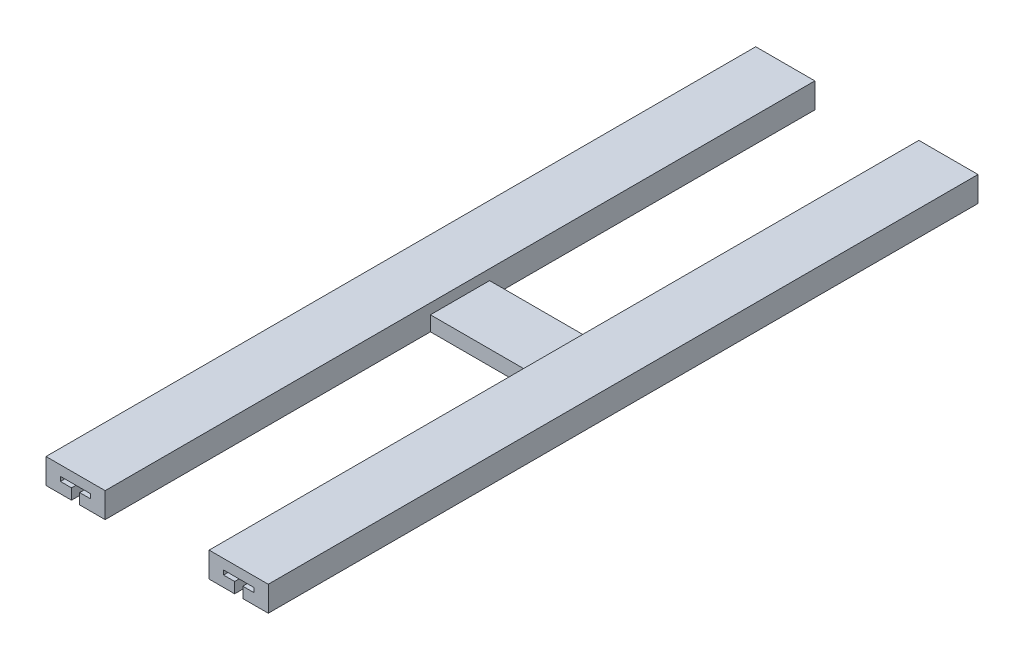
ISO-10303-21;
HEADER;
FILE_DESCRIPTION(('STEP AP214'),'2;1');
FILE_NAME('part.step','',(''),(''),'','','');
FILE_SCHEMA(('AUTOMOTIVE_DESIGN { 1 0 10303 214 1 1 1 1 }'));
ENDSEC;
DATA;
#1=APPLICATION_CONTEXT('core data for automotive mechanical design processes');
#2=APPLICATION_PROTOCOL_DEFINITION('international standard','automotive_design',2000,#1);
#3=PRODUCT_CONTEXT('',#1,'mechanical');
#4=PRODUCT('Part','Part','',(#3));
#5=PRODUCT_RELATED_PRODUCT_CATEGORY('part','',(#4));
#6=PRODUCT_DEFINITION_FORMATION('','',#4);
#7=PRODUCT_DEFINITION_CONTEXT('part definition',#1,'design');
#8=PRODUCT_DEFINITION('design','',#6,#7);
#9=PRODUCT_DEFINITION_SHAPE('','',#8);
#10=(LENGTH_UNIT() NAMED_UNIT(*) SI_UNIT(.MILLI.,.METRE.));
#11=(NAMED_UNIT(*) PLANE_ANGLE_UNIT() SI_UNIT($,.RADIAN.));
#12=(NAMED_UNIT(*) SI_UNIT($,.STERADIAN.) SOLID_ANGLE_UNIT());
#13=UNCERTAINTY_MEASURE_WITH_UNIT(LENGTH_MEASURE(1.E-05),#10,'distance_accuracy_value','');
#14=(GEOMETRIC_REPRESENTATION_CONTEXT(3) GLOBAL_UNCERTAINTY_ASSIGNED_CONTEXT((#13)) GLOBAL_UNIT_ASSIGNED_CONTEXT((#10,
#11,#12)) REPRESENTATION_CONTEXT('',''));
#15=CARTESIAN_POINT('',(0.,0.,0.));
#16=DIRECTION('',(0.,0.,1.));
#17=DIRECTION('',(1.,0.,0.));
#18=AXIS2_PLACEMENT_3D('',#15,#16,#17);
#19=CARTESIAN_POINT('',(110.,17.,-10.));
#20=DIRECTION('',(0.,0.,-1.));
#21=DIRECTION('',(-1.,0.,0.));
#22=AXIS2_PLACEMENT_3D('',#19,#20,#21);
#23=PLANE('',#22);
#24=DIRECTION('',(0.,-1.,0.));
#25=VECTOR('',#24,1.);
#26=CARTESIAN_POINT('',(127.25,17.,-10.));
#27=LINE('',#26,#25);
#28=CARTESIAN_POINT('',(127.25,7.25,-10.));
#29=VERTEX_POINT('',#28);
#30=CARTESIAN_POINT('',(127.25,0.,-10.));
#31=VERTEX_POINT('',#30);
#32=EDGE_CURVE('E270',#29,#31,#27,.T.);
#33=ORIENTED_EDGE('',*,*,#32,.F.);
#34=DIRECTION('',(1.,0.,0.));
#35=VECTOR('',#34,1.);
#36=CARTESIAN_POINT('',(110.,7.25,-10.));
#37=LINE('',#36,#35);
#38=CARTESIAN_POINT('',(119.75,7.25,-10.));
#39=VERTEX_POINT('',#38);
#40=EDGE_CURVE('E280',#39,#29,#37,.T.);
#41=ORIENTED_EDGE('',*,*,#40,.F.);
#42=DIRECTION('',(0.,-1.,0.));
#43=VECTOR('',#42,1.);
#44=CARTESIAN_POINT('',(119.75,17.,-10.));
#45=LINE('',#44,#43);
#46=CARTESIAN_POINT('',(119.75,10.25,-10.));
#47=VERTEX_POINT('',#46);
#48=EDGE_CURVE('E278',#47,#39,#45,.T.);
#49=ORIENTED_EDGE('',*,*,#48,.F.);
#50=DIRECTION('',(-1.,0.,0.));
#51=VECTOR('',#50,1.);
#52=CARTESIAN_POINT('',(110.,10.25,-10.));
#53=LINE('',#52,#51);
#54=CARTESIAN_POINT('',(140.25,10.25,-10.));
#55=VERTEX_POINT('',#54);
#56=EDGE_CURVE('E276',#55,#47,#53,.T.);
#57=ORIENTED_EDGE('',*,*,#56,.F.);
#58=DIRECTION('',(0.,1.,0.));
#59=VECTOR('',#58,1.);
#60=CARTESIAN_POINT('',(140.25,17.,-10.));
#61=LINE('',#60,#59);
#62=CARTESIAN_POINT('',(140.25,7.25,-10.));
#63=VERTEX_POINT('',#62);
#64=EDGE_CURVE('E274',#63,#55,#61,.T.);
#65=ORIENTED_EDGE('',*,*,#64,.F.);
#66=DIRECTION('',(1.,0.,0.));
#67=VECTOR('',#66,1.);
#68=CARTESIAN_POINT('',(110.,7.24999999999999,-10.));
#69=LINE('',#68,#67);
#70=CARTESIAN_POINT('',(132.75,7.25,-10.));
#71=VERTEX_POINT('',#70);
#72=EDGE_CURVE('E272',#71,#63,#69,.T.);
#73=ORIENTED_EDGE('',*,*,#72,.F.);
#74=DIRECTION('',(0.,1.,0.));
#75=VECTOR('',#74,1.);
#76=CARTESIAN_POINT('',(132.75,17.,-10.));
#77=LINE('',#76,#75);
#78=CARTESIAN_POINT('',(132.75,0.,-10.));
#79=VERTEX_POINT('',#78);
#80=EDGE_CURVE('E232',#79,#71,#77,.T.);
#81=ORIENTED_EDGE('',*,*,#80,.F.);
#82=DIRECTION('',(1.,0.,0.));
#83=VECTOR('',#82,1.);
#84=CARTESIAN_POINT('',(110.,0.,-10.));
#85=LINE('',#84,#83);
#86=CARTESIAN_POINT('',(150.,0.,-10.));
#87=VERTEX_POINT('',#86);
#88=EDGE_CURVE('E386',#79,#87,#85,.T.);
#89=ORIENTED_EDGE('',*,*,#88,.T.);
#90=DIRECTION('',(0.,-1.,0.));
#91=VECTOR('',#90,1.);
#92=CARTESIAN_POINT('',(150.,17.,-10.));
#93=LINE('',#92,#91);
#94=CARTESIAN_POINT('',(150.,17.,-10.));
#95=VERTEX_POINT('',#94);
#96=EDGE_CURVE('E402',#95,#87,#93,.T.);
#97=ORIENTED_EDGE('',*,*,#96,.F.);
#98=DIRECTION('',(1.,0.,0.));
#99=VECTOR('',#98,1.);
#100=CARTESIAN_POINT('',(110.,17.,-10.));
#101=LINE('',#100,#99);
#102=CARTESIAN_POINT('',(110.,17.,-10.));
#103=VERTEX_POINT('',#102);
#104=EDGE_CURVE('E356',#103,#95,#101,.T.);
#105=ORIENTED_EDGE('',*,*,#104,.F.);
#106=DIRECTION('',(0.,-1.,0.));
#107=VECTOR('',#106,1.);
#108=CARTESIAN_POINT('',(110.,17.,-10.));
#109=LINE('',#108,#107);
#110=CARTESIAN_POINT('',(110.,0.,-10.));
#111=VERTEX_POINT('',#110);
#112=EDGE_CURVE('E405',#103,#111,#109,.T.);
#113=ORIENTED_EDGE('',*,*,#112,.T.);
#114=EDGE_CURVE('E387',#111,#31,#85,.T.);
#115=ORIENTED_EDGE('',*,*,#114,.T.);
#116=EDGE_LOOP('',(#33,#41,#49,#57,#65,#73,#81,#89,#97,#105,#113,#115));
#117=FACE_BOUND('',#116,.T.);
#118=ADVANCED_FACE('F33',(#117),#23,.F.);
#119=CARTESIAN_POINT('',(110.,17.,-490.));
#120=DIRECTION('',(0.,0.,1.));
#121=DIRECTION('',(1.,0.,0.));
#122=AXIS2_PLACEMENT_3D('',#119,#120,#121);
#123=PLANE('',#122);
#124=DIRECTION('',(0.,1.,0.));
#125=VECTOR('',#124,1.);
#126=CARTESIAN_POINT('',(127.25,7.25,-490.));
#127=LINE('',#126,#125);
#128=CARTESIAN_POINT('',(127.25,0.,-490.));
#129=VERTEX_POINT('',#128);
#130=CARTESIAN_POINT('',(127.25,7.25,-490.));
#131=VERTEX_POINT('',#130);
#132=EDGE_CURVE('E250',#129,#131,#127,.T.);
#133=ORIENTED_EDGE('',*,*,#132,.F.);
#134=DIRECTION('',(-1.,0.,0.));
#135=VECTOR('',#134,1.);
#136=CARTESIAN_POINT('',(110.,0.,-490.));
#137=LINE('',#136,#135);
#138=CARTESIAN_POINT('',(110.,0.,-490.));
#139=VERTEX_POINT('',#138);
#140=EDGE_CURVE('E392',#129,#139,#137,.T.);
#141=ORIENTED_EDGE('',*,*,#140,.T.);
#142=DIRECTION('',(0.,-1.,0.));
#143=VECTOR('',#142,1.);
#144=CARTESIAN_POINT('',(110.,17.,-490.));
#145=LINE('',#144,#143);
#146=CARTESIAN_POINT('',(110.,17.,-490.));
#147=VERTEX_POINT('',#146);
#148=EDGE_CURVE('E397',#147,#139,#145,.T.);
#149=ORIENTED_EDGE('',*,*,#148,.F.);
#150=DIRECTION('',(-1.,0.,0.));
#151=VECTOR('',#150,1.);
#152=CARTESIAN_POINT('',(110.,17.,-490.));
#153=LINE('',#152,#151);
#154=CARTESIAN_POINT('',(150.,17.,-490.));
#155=VERTEX_POINT('',#154);
#156=EDGE_CURVE('E360',#155,#147,#153,.T.);
#157=ORIENTED_EDGE('',*,*,#156,.F.);
#158=DIRECTION('',(0.,-1.,0.));
#159=VECTOR('',#158,1.);
#160=CARTESIAN_POINT('',(150.,17.,-490.));
#161=LINE('',#160,#159);
#162=CARTESIAN_POINT('',(150.,0.,-490.));
#163=VERTEX_POINT('',#162);
#164=EDGE_CURVE('E400',#155,#163,#161,.T.);
#165=ORIENTED_EDGE('',*,*,#164,.T.);
#166=CARTESIAN_POINT('',(132.75,0.,-490.));
#167=VERTEX_POINT('',#166);
#168=EDGE_CURVE('E240',#163,#167,#137,.T.);
#169=ORIENTED_EDGE('',*,*,#168,.T.);
#170=DIRECTION('',(0.,-1.,0.));
#171=VECTOR('',#170,1.);
#172=CARTESIAN_POINT('',(132.75,0.,-490.));
#173=LINE('',#172,#171);
#174=CARTESIAN_POINT('',(132.75,7.25,-490.));
#175=VERTEX_POINT('',#174);
#176=EDGE_CURVE('E48',#175,#167,#173,.T.);
#177=ORIENTED_EDGE('',*,*,#176,.F.);
#178=DIRECTION('',(-1.,0.,0.));
#179=VECTOR('',#178,1.);
#180=CARTESIAN_POINT('',(132.75,7.25,-490.));
#181=LINE('',#180,#179);
#182=CARTESIAN_POINT('',(140.25,7.25,-490.));
#183=VERTEX_POINT('',#182);
#184=EDGE_CURVE('E220',#183,#175,#181,.T.);
#185=ORIENTED_EDGE('',*,*,#184,.F.);
#186=DIRECTION('',(0.,-1.,0.));
#187=VECTOR('',#186,1.);
#188=CARTESIAN_POINT('',(140.25,7.25,-490.));
#189=LINE('',#188,#187);
#190=CARTESIAN_POINT('',(140.25,10.25,-490.));
#191=VERTEX_POINT('',#190);
#192=EDGE_CURVE('E228',#191,#183,#189,.T.);
#193=ORIENTED_EDGE('',*,*,#192,.F.);
#194=DIRECTION('',(1.,0.,0.));
#195=VECTOR('',#194,1.);
#196=CARTESIAN_POINT('',(140.25,10.25,-490.));
#197=LINE('',#196,#195);
#198=CARTESIAN_POINT('',(119.75,10.25,-490.));
#199=VERTEX_POINT('',#198);
#200=EDGE_CURVE('E244',#199,#191,#197,.T.);
#201=ORIENTED_EDGE('',*,*,#200,.F.);
#202=DIRECTION('',(0.,1.,0.));
#203=VECTOR('',#202,1.);
#204=CARTESIAN_POINT('',(119.75,10.25,-490.));
#205=LINE('',#204,#203);
#206=CARTESIAN_POINT('',(119.75,7.25,-490.));
#207=VERTEX_POINT('',#206);
#208=EDGE_CURVE('E246',#207,#199,#205,.T.);
#209=ORIENTED_EDGE('',*,*,#208,.F.);
#210=DIRECTION('',(-1.,0.,0.));
#211=VECTOR('',#210,1.);
#212=CARTESIAN_POINT('',(119.75,7.25,-490.));
#213=LINE('',#212,#211);
#214=EDGE_CURVE('E248',#131,#207,#213,.T.);
#215=ORIENTED_EDGE('',*,*,#214,.F.);
#216=EDGE_LOOP('',(#133,#141,#149,#157,#165,#169,#177,#185,#193,#201,#209,#215));
#217=FACE_BOUND('',#216,.T.);
#218=ADVANCED_FACE('F237',(#217),#123,.F.);
#219=CARTESIAN_POINT('',(0.,0.,0.));
#220=DIRECTION('',(0.,-1.,0.));
#221=DIRECTION('',(0.,0.,-1.));
#222=AXIS2_PLACEMENT_3D('',#219,#220,#221);
#223=PLANE('',#222);
#224=ORIENTED_EDGE('',*,*,#140,.F.);
#225=DIRECTION('',(0.,0.,1.));
#226=VECTOR('',#225,1.);
#227=CARTESIAN_POINT('',(127.25,0.,-490.));
#228=LINE('',#227,#226);
#229=EDGE_CURVE('E252',#129,#31,#228,.T.);
#230=ORIENTED_EDGE('',*,*,#229,.T.);
#231=ORIENTED_EDGE('',*,*,#114,.F.);
#232=DIRECTION('',(0.,0.,1.));
#233=VECTOR('',#232,1.);
#234=CARTESIAN_POINT('',(110.,0.,-229.668143970884));
#235=LINE('',#234,#233);
#236=CARTESIAN_POINT('',(110.,0.,-229.668143970884));
#237=VERTEX_POINT('',#236);
#238=EDGE_CURVE('E384',#237,#111,#235,.T.);
#239=ORIENTED_EDGE('',*,*,#238,.F.);
#240=DIRECTION('',(1.,0.,0.));
#241=VECTOR('',#240,1.);
#242=CARTESIAN_POINT('',(40.,0.,-229.668143970884));
#243=LINE('',#242,#241);
#244=CARTESIAN_POINT('',(40.,0.,-229.668143970884));
#245=VERTEX_POINT('',#244);
#246=EDGE_CURVE('E381',#245,#237,#243,.T.);
#247=ORIENTED_EDGE('',*,*,#246,.F.);
#248=DIRECTION('',(0.,0.,-1.));
#249=VECTOR('',#248,1.);
#250=CARTESIAN_POINT('',(40.,0.,-229.668143970884));
#251=LINE('',#250,#249);
#252=CARTESIAN_POINT('',(40.0000000000001,0.,-9.66814397088413));
#253=VERTEX_POINT('',#252);
#254=EDGE_CURVE('E378',#253,#245,#251,.T.);
#255=ORIENTED_EDGE('',*,*,#254,.F.);
#256=DIRECTION('',(1.,0.,0.));
#257=VECTOR('',#256,1.);
#258=CARTESIAN_POINT('',(0.,0.,-9.66814397088413));
#259=LINE('',#258,#257);
#260=CARTESIAN_POINT('',(22.75,0.,-9.66814397088413));
#261=VERTEX_POINT('',#260);
#262=EDGE_CURVE('E374',#261,#253,#259,.T.);
#263=ORIENTED_EDGE('',*,*,#262,.F.);
#264=DIRECTION('',(0.,0.,1.));
#265=VECTOR('',#264,1.);
#266=CARTESIAN_POINT('',(22.75,0.,0.));
#267=LINE('',#266,#265);
#268=CARTESIAN_POINT('',(22.75,0.,-489.668143970884));
#269=VERTEX_POINT('',#268);
#270=EDGE_CURVE('E41',#269,#261,#267,.T.);
#271=ORIENTED_EDGE('',*,*,#270,.F.);
#272=DIRECTION('',(-1.,0.,0.));
#273=VECTOR('',#272,1.);
#274=CARTESIAN_POINT('',(0.,0.,-489.668143970884));
#275=LINE('',#274,#273);
#276=CARTESIAN_POINT('',(40.0000000000001,0.,-489.668143970884));
#277=VERTEX_POINT('',#276);
#278=EDGE_CURVE('E369',#277,#269,#275,.T.);
#279=ORIENTED_EDGE('',*,*,#278,.F.);
#280=DIRECTION('',(0.,0.,-1.));
#281=VECTOR('',#280,1.);
#282=CARTESIAN_POINT('',(40.0000000000001,0.,-489.668143970884));
#283=LINE('',#282,#281);
#284=CARTESIAN_POINT('',(40.,0.,-269.668143970884));
#285=VERTEX_POINT('',#284);
#286=EDGE_CURVE('E366',#285,#277,#283,.T.);
#287=ORIENTED_EDGE('',*,*,#286,.F.);
#288=DIRECTION('',(-1.,0.,0.));
#289=VECTOR('',#288,1.);
#290=CARTESIAN_POINT('',(40.,0.,-269.668143970884));
#291=LINE('',#290,#289);
#292=CARTESIAN_POINT('',(110.,0.,-269.668143970884));
#293=VERTEX_POINT('',#292);
#294=EDGE_CURVE('E343',#293,#285,#291,.T.);
#295=ORIENTED_EDGE('',*,*,#294,.F.);
#296=DIRECTION('',(0.,0.,1.));
#297=VECTOR('',#296,1.);
#298=CARTESIAN_POINT('',(110.,0.,-490.));
#299=LINE('',#298,#297);
#300=EDGE_CURVE('E347',#139,#293,#299,.T.);
#301=ORIENTED_EDGE('',*,*,#300,.F.);
#302=EDGE_LOOP('',(#224,#230,#231,#239,#247,#255,#263,#271,#279,#287,#295,#301));
#303=FACE_BOUND('',#302,.T.);
#304=ADVANCED_FACE('F437',(#303),#223,.T.);
#305=ORIENTED_EDGE('',*,*,#88,.F.);
#306=DIRECTION('',(0.,0.,1.));
#307=VECTOR('',#306,1.);
#308=CARTESIAN_POINT('',(132.75,0.,-490.));
#309=LINE('',#308,#307);
#310=EDGE_CURVE('E233',#167,#79,#309,.T.);
#311=ORIENTED_EDGE('',*,*,#310,.F.);
#312=ORIENTED_EDGE('',*,*,#168,.F.);
#313=DIRECTION('',(0.,0.,-1.));
#314=VECTOR('',#313,1.);
#315=CARTESIAN_POINT('',(150.,0.,-10.));
#316=LINE('',#315,#314);
#317=EDGE_CURVE('E390',#87,#163,#316,.T.);
#318=ORIENTED_EDGE('',*,*,#317,.F.);
#319=EDGE_LOOP('',(#305,#311,#312,#318));
#320=FACE_BOUND('',#319,.T.);
#321=ADVANCED_FACE('F554',(#320),#223,.T.);
#322=DIRECTION('',(0.,0.,-1.));
#323=VECTOR('',#322,1.);
#324=CARTESIAN_POINT('',(17.25,0.,0.));
#325=LINE('',#324,#323);
#326=CARTESIAN_POINT('',(17.25,0.,-9.66814397088413));
#327=VERTEX_POINT('',#326);
#328=CARTESIAN_POINT('',(17.25,0.,-489.668143970884));
#329=VERTEX_POINT('',#328);
#330=EDGE_CURVE('E11',#327,#329,#325,.T.);
#331=ORIENTED_EDGE('',*,*,#330,.F.);
#332=CARTESIAN_POINT('',(0.,0.,-9.66814397088413));
#333=VERTEX_POINT('',#332);
#334=EDGE_CURVE('E375',#333,#327,#259,.T.);
#335=ORIENTED_EDGE('',*,*,#334,.F.);
#336=DIRECTION('',(0.,0.,1.));
#337=VECTOR('',#336,1.);
#338=CARTESIAN_POINT('',(0.,0.,-9.66814397088413));
#339=LINE('',#338,#337);
#340=CARTESIAN_POINT('',(0.,0.,-489.668143970884));
#341=VERTEX_POINT('',#340);
#342=EDGE_CURVE('E372',#341,#333,#339,.T.);
#343=ORIENTED_EDGE('',*,*,#342,.F.);
#344=EDGE_CURVE('E368',#329,#341,#275,.T.);
#345=ORIENTED_EDGE('',*,*,#344,.F.);
#346=EDGE_LOOP('',(#331,#335,#343,#345));
#347=FACE_BOUND('',#346,.T.);
#348=ADVANCED_FACE('F458',(#347),#223,.T.);
#349=CARTESIAN_POINT('',(40.,17.,-269.668143970884));
#350=DIRECTION('',(0.,0.,1.));
#351=DIRECTION('',(1.,0.,0.));
#352=AXIS2_PLACEMENT_3D('',#349,#350,#351);
#353=PLANE('',#352);
#354=DIRECTION('',(-1.,0.,0.));
#355=VECTOR('',#354,1.);
#356=CARTESIAN_POINT('',(40.,10.,-269.668143970884));
#357=LINE('',#356,#355);
#358=CARTESIAN_POINT('',(110.,10.,-269.668143970884));
#359=VERTEX_POINT('',#358);
#360=CARTESIAN_POINT('',(40.,10.,-269.668143970884));
#361=VERTEX_POINT('',#360);
#362=EDGE_CURVE('E340',#359,#361,#357,.T.);
#363=ORIENTED_EDGE('',*,*,#362,.F.);
#364=DIRECTION('',(0.,-1.,0.));
#365=VECTOR('',#364,1.);
#366=CARTESIAN_POINT('',(110.,17.,-269.668143970884));
#367=LINE('',#366,#365);
#368=EDGE_CURVE('E363',#359,#293,#367,.T.);
#369=ORIENTED_EDGE('',*,*,#368,.T.);
#370=ORIENTED_EDGE('',*,*,#294,.T.);
#371=DIRECTION('',(0.,-1.,0.));
#372=VECTOR('',#371,1.);
#373=CARTESIAN_POINT('',(40.,17.,-269.668143970884));
#374=LINE('',#373,#372);
#375=EDGE_CURVE('E424',#361,#285,#374,.T.);
#376=ORIENTED_EDGE('',*,*,#375,.F.);
#377=EDGE_LOOP('',(#363,#369,#370,#376));
#378=FACE_BOUND('',#377,.T.);
#379=ADVANCED_FACE('F35',(#378),#353,.F.);
#380=CARTESIAN_POINT('',(40.,17.,-229.668143970884));
#381=DIRECTION('',(0.,0.,-1.));
#382=DIRECTION('',(-1.,0.,0.));
#383=AXIS2_PLACEMENT_3D('',#380,#381,#382);
#384=PLANE('',#383);
#385=DIRECTION('',(1.,0.,0.));
#386=VECTOR('',#385,1.);
#387=CARTESIAN_POINT('',(40.,10.,-229.668143970884));
#388=LINE('',#387,#386);
#389=CARTESIAN_POINT('',(40.,10.,-229.668143970884));
#390=VERTEX_POINT('',#389);
#391=CARTESIAN_POINT('',(110.,10.,-229.668143970884));
#392=VERTEX_POINT('',#391);
#393=EDGE_CURVE('E335',#390,#392,#388,.T.);
#394=ORIENTED_EDGE('',*,*,#393,.F.);
#395=DIRECTION('',(0.,-1.,0.));
#396=VECTOR('',#395,1.);
#397=CARTESIAN_POINT('',(40.,17.,-229.668143970884));
#398=LINE('',#397,#396);
#399=EDGE_CURVE('E410',#390,#245,#398,.T.);
#400=ORIENTED_EDGE('',*,*,#399,.T.);
#401=ORIENTED_EDGE('',*,*,#246,.T.);
#402=DIRECTION('',(0.,-1.,0.));
#403=VECTOR('',#402,1.);
#404=CARTESIAN_POINT('',(110.,17.,-229.668143970884));
#405=LINE('',#404,#403);
#406=EDGE_CURVE('E408',#392,#237,#405,.T.);
#407=ORIENTED_EDGE('',*,*,#406,.F.);
#408=EDGE_LOOP('',(#394,#400,#401,#407));
#409=FACE_BOUND('',#408,.T.);
#410=ADVANCED_FACE('F512',(#409),#384,.F.);
#411=CARTESIAN_POINT('',(0.,17.,0.));
#412=DIRECTION('',(0.,-1.,0.));
#413=DIRECTION('',(0.,0.,-1.));
#414=AXIS2_PLACEMENT_3D('',#411,#412,#413);
#415=PLANE('',#414);
#416=DIRECTION('',(1.,0.,0.));
#417=VECTOR('',#416,1.);
#418=CARTESIAN_POINT('',(0.,17.,-9.66814397088413));
#419=LINE('',#418,#417);
#420=CARTESIAN_POINT('',(0.,17.,-9.66814397088413));
#421=VERTEX_POINT('',#420);
#422=CARTESIAN_POINT('',(40.0000000000001,17.,-9.66814397088413));
#423=VERTEX_POINT('',#422);
#424=EDGE_CURVE('E351',#421,#423,#419,.T.);
#425=ORIENTED_EDGE('',*,*,#424,.T.);
#426=DIRECTION('',(0.,0.,-1.));
#427=VECTOR('',#426,1.);
#428=CARTESIAN_POINT('',(40.0000000000001,17.,-489.668143970884));
#429=LINE('',#428,#427);
#430=CARTESIAN_POINT('',(40.0000000000001,17.,-489.668143970884));
#431=VERTEX_POINT('',#430);
#432=EDGE_CURVE('E344',#423,#431,#429,.T.);
#433=ORIENTED_EDGE('',*,*,#432,.T.);
#434=DIRECTION('',(-1.,0.,0.));
#435=VECTOR('',#434,1.);
#436=CARTESIAN_POINT('',(0.,17.,-489.668143970884));
#437=LINE('',#436,#435);
#438=CARTESIAN_POINT('',(0.,17.,-489.668143970884));
#439=VERTEX_POINT('',#438);
#440=EDGE_CURVE('E346',#431,#439,#437,.T.);
#441=ORIENTED_EDGE('',*,*,#440,.T.);
#442=DIRECTION('',(0.,0.,1.));
#443=VECTOR('',#442,1.);
#444=CARTESIAN_POINT('',(0.,17.,-9.66814397088413));
#445=LINE('',#444,#443);
#446=EDGE_CURVE('E349',#439,#421,#445,.T.);
#447=ORIENTED_EDGE('',*,*,#446,.T.);
#448=EDGE_LOOP('',(#425,#433,#441,#447));
#449=FACE_BOUND('',#448,.T.);
#450=ADVANCED_FACE('F448',(#449),#415,.F.);
#451=CARTESIAN_POINT('',(0.,17.,-489.668143970884));
#452=DIRECTION('',(0.,0.,1.));
#453=DIRECTION('',(1.,0.,0.));
#454=AXIS2_PLACEMENT_3D('',#451,#452,#453);
#455=PLANE('',#454);
#456=DIRECTION('',(1.,0.,0.));
#457=VECTOR('',#456,1.);
#458=CARTESIAN_POINT('',(0.,7.25,-489.668143970884));
#459=LINE('',#458,#457);
#460=CARTESIAN_POINT('',(9.75000000000003,7.25,-489.668143970884));
#461=VERTEX_POINT('',#460);
#462=CARTESIAN_POINT('',(17.25,7.25,-489.668143970884));
#463=VERTEX_POINT('',#462);
#464=EDGE_CURVE('E330',#461,#463,#459,.T.);
#465=ORIENTED_EDGE('',*,*,#464,.T.);
#466=DIRECTION('',(0.,-1.,0.));
#467=VECTOR('',#466,1.);
#468=CARTESIAN_POINT('',(17.25,17.,-489.668143970884));
#469=LINE('',#468,#467);
#470=EDGE_CURVE('E315',#463,#329,#469,.T.);
#471=ORIENTED_EDGE('',*,*,#470,.T.);
#472=ORIENTED_EDGE('',*,*,#344,.T.);
#473=DIRECTION('',(0.,-1.,0.));
#474=VECTOR('',#473,1.);
#475=CARTESIAN_POINT('',(0.,17.,-489.668143970884));
#476=LINE('',#475,#474);
#477=EDGE_CURVE('E418',#439,#341,#476,.T.);
#478=ORIENTED_EDGE('',*,*,#477,.F.);
#479=ORIENTED_EDGE('',*,*,#440,.F.);
#480=DIRECTION('',(0.,-1.,0.));
#481=VECTOR('',#480,1.);
#482=CARTESIAN_POINT('',(40.0000000000001,17.,-489.668143970884));
#483=LINE('',#482,#481);
#484=EDGE_CURVE('E421',#431,#277,#483,.T.);
#485=ORIENTED_EDGE('',*,*,#484,.T.);
#486=ORIENTED_EDGE('',*,*,#278,.T.);
#487=DIRECTION('',(0.,1.,0.));
#488=VECTOR('',#487,1.);
#489=CARTESIAN_POINT('',(22.75,17.,-489.668143970884));
#490=LINE('',#489,#488);
#491=CARTESIAN_POINT('',(22.75,7.25,-489.668143970884));
#492=VERTEX_POINT('',#491);
#493=EDGE_CURVE('E56',#269,#492,#490,.T.);
#494=ORIENTED_EDGE('',*,*,#493,.T.);
#495=DIRECTION('',(1.,0.,0.));
#496=VECTOR('',#495,1.);
#497=CARTESIAN_POINT('',(0.,7.24999999999999,-489.668143970884));
#498=LINE('',#497,#496);
#499=CARTESIAN_POINT('',(30.25,7.25,-489.668143970884));
#500=VERTEX_POINT('',#499);
#501=EDGE_CURVE('E318',#492,#500,#498,.T.);
#502=ORIENTED_EDGE('',*,*,#501,.T.);
#503=DIRECTION('',(0.,1.,0.));
#504=VECTOR('',#503,1.);
#505=CARTESIAN_POINT('',(30.25,17.,-489.668143970884));
#506=LINE('',#505,#504);
#507=CARTESIAN_POINT('',(30.25,10.25,-489.668143970884));
#508=VERTEX_POINT('',#507);
#509=EDGE_CURVE('E321',#500,#508,#506,.T.);
#510=ORIENTED_EDGE('',*,*,#509,.T.);
#511=DIRECTION('',(-1.,0.,0.));
#512=VECTOR('',#511,1.);
#513=CARTESIAN_POINT('',(0.,10.25,-489.668143970884));
#514=LINE('',#513,#512);
#515=CARTESIAN_POINT('',(9.75000000000003,10.25,-489.668143970884));
#516=VERTEX_POINT('',#515);
#517=EDGE_CURVE('E324',#508,#516,#514,.T.);
#518=ORIENTED_EDGE('',*,*,#517,.T.);
#519=DIRECTION('',(0.,-1.,0.));
#520=VECTOR('',#519,1.);
#521=CARTESIAN_POINT('',(9.75000000000002,17.,-489.668143970884));
#522=LINE('',#521,#520);
#523=EDGE_CURVE('E327',#516,#461,#522,.T.);
#524=ORIENTED_EDGE('',*,*,#523,.T.);
#525=EDGE_LOOP('',(#465,#471,#472,#478,#479,#485,#486,#494,#502,#510,#518,#524));
#526=FACE_BOUND('',#525,.T.);
#527=ADVANCED_FACE('F481',(#526),#455,.F.);
#528=CARTESIAN_POINT('',(0.,17.,-9.66814397088413));
#529=DIRECTION('',(1.,0.,0.));
#530=DIRECTION('',(0.,0.,-1.));
#531=AXIS2_PLACEMENT_3D('',#528,#529,#530);
#532=PLANE('',#531);
#533=ORIENTED_EDGE('',*,*,#342,.T.);
#534=DIRECTION('',(0.,-1.,0.));
#535=VECTOR('',#534,1.);
#536=CARTESIAN_POINT('',(0.,17.,-9.66814397088413));
#537=LINE('',#536,#535);
#538=EDGE_CURVE('E415',#421,#333,#537,.T.);
#539=ORIENTED_EDGE('',*,*,#538,.F.);
#540=ORIENTED_EDGE('',*,*,#446,.F.);
#541=ORIENTED_EDGE('',*,*,#477,.T.);
#542=EDGE_LOOP('',(#533,#539,#540,#541));
#543=FACE_BOUND('',#542,.T.);
#544=ADVANCED_FACE('F453',(#543),#532,.F.);
#545=CARTESIAN_POINT('',(0.,17.,-9.66814397088413));
#546=DIRECTION('',(0.,0.,-1.));
#547=DIRECTION('',(-1.,0.,0.));
#548=AXIS2_PLACEMENT_3D('',#545,#546,#547);
#549=PLANE('',#548);
#550=ORIENTED_EDGE('',*,*,#334,.T.);
#551=DIRECTION('',(0.,-1.,0.));
#552=VECTOR('',#551,1.);
#553=CARTESIAN_POINT('',(17.25,0.,-9.66814397088413));
#554=LINE('',#553,#552);
#555=CARTESIAN_POINT('',(17.25,7.25,-9.66814397088413));
#556=VERTEX_POINT('',#555);
#557=EDGE_CURVE('E300',#556,#327,#554,.T.);
#558=ORIENTED_EDGE('',*,*,#557,.F.);
#559=DIRECTION('',(1.,0.,0.));
#560=VECTOR('',#559,1.);
#561=CARTESIAN_POINT('',(17.25,7.25,-9.66814397088413));
#562=LINE('',#561,#560);
#563=CARTESIAN_POINT('',(9.75000000000003,7.25,-9.66814397088413));
#564=VERTEX_POINT('',#563);
#565=EDGE_CURVE('E297',#564,#556,#562,.T.);
#566=ORIENTED_EDGE('',*,*,#565,.F.);
#567=DIRECTION('',(0.,-1.,0.));
#568=VECTOR('',#567,1.);
#569=CARTESIAN_POINT('',(9.75000000000003,7.25,-9.66814397088413));
#570=LINE('',#569,#568);
#571=CARTESIAN_POINT('',(9.75000000000003,10.25,-9.66814397088413));
#572=VERTEX_POINT('',#571);
#573=EDGE_CURVE('E294',#572,#564,#570,.T.);
#574=ORIENTED_EDGE('',*,*,#573,.F.);
#575=DIRECTION('',(-1.,0.,0.));
#576=VECTOR('',#575,1.);
#577=CARTESIAN_POINT('',(9.75000000000003,10.25,-9.66814397088413));
#578=LINE('',#577,#576);
#579=CARTESIAN_POINT('',(30.25,10.25,-9.66814397088413));
#580=VERTEX_POINT('',#579);
#581=EDGE_CURVE('E291',#580,#572,#578,.T.);
#582=ORIENTED_EDGE('',*,*,#581,.F.);
#583=DIRECTION('',(0.,1.,0.));
#584=VECTOR('',#583,1.);
#585=CARTESIAN_POINT('',(30.25,10.25,-9.66814397088413));
#586=LINE('',#585,#584);
#587=CARTESIAN_POINT('',(30.25,7.25,-9.66814397088413));
#588=VERTEX_POINT('',#587);
#589=EDGE_CURVE('E288',#588,#580,#586,.T.);
#590=ORIENTED_EDGE('',*,*,#589,.F.);
#591=DIRECTION('',(1.,0.,0.));
#592=VECTOR('',#591,1.);
#593=CARTESIAN_POINT('',(30.25,7.25,-9.66814397088413));
#594=LINE('',#593,#592);
#595=CARTESIAN_POINT('',(22.75,7.25,-9.66814397088413));
#596=VERTEX_POINT('',#595);
#597=EDGE_CURVE('E285',#596,#588,#594,.T.);
#598=ORIENTED_EDGE('',*,*,#597,.F.);
#599=DIRECTION('',(0.,1.,0.));
#600=VECTOR('',#599,1.);
#601=CARTESIAN_POINT('',(22.75,7.25,-9.66814397088413));
#602=LINE('',#601,#600);
#603=EDGE_CURVE('E282',#261,#596,#602,.T.);
#604=ORIENTED_EDGE('',*,*,#603,.F.);
#605=ORIENTED_EDGE('',*,*,#262,.T.);
#606=DIRECTION('',(0.,-1.,0.));
#607=VECTOR('',#606,1.);
#608=CARTESIAN_POINT('',(40.0000000000001,17.,-9.66814397088413));
#609=LINE('',#608,#607);
#610=EDGE_CURVE('E412',#423,#253,#609,.T.);
#611=ORIENTED_EDGE('',*,*,#610,.F.);
#612=ORIENTED_EDGE('',*,*,#424,.F.);
#613=ORIENTED_EDGE('',*,*,#538,.T.);
#614=EDGE_LOOP('',(#550,#558,#566,#574,#582,#590,#598,#604,#605,#611,#612,#613));
#615=FACE_BOUND('',#614,.T.);
#616=ADVANCED_FACE('F432',(#615),#549,.F.);
#617=CARTESIAN_POINT('',(40.,17.,-229.668143970884));
#618=DIRECTION('',(-1.,0.,0.));
#619=DIRECTION('',(0.,0.,1.));
#620=AXIS2_PLACEMENT_3D('',#617,#618,#619);
#621=PLANE('',#620);
#622=ORIENTED_EDGE('',*,*,#254,.T.);
#623=ORIENTED_EDGE('',*,*,#399,.F.);
#624=DIRECTION('',(0.,0.,1.));
#625=VECTOR('',#624,1.);
#626=CARTESIAN_POINT('',(40.,10.,-269.668143970884));
#627=LINE('',#626,#625);
#628=EDGE_CURVE('E333',#361,#390,#627,.T.);
#629=ORIENTED_EDGE('',*,*,#628,.F.);
#630=ORIENTED_EDGE('',*,*,#375,.T.);
#631=ORIENTED_EDGE('',*,*,#286,.T.);
#632=ORIENTED_EDGE('',*,*,#484,.F.);
#633=ORIENTED_EDGE('',*,*,#432,.F.);
#634=ORIENTED_EDGE('',*,*,#610,.T.);
#635=EDGE_LOOP('',(#622,#623,#629,#630,#631,#632,#633,#634));
#636=FACE_BOUND('',#635,.T.);
#637=ADVANCED_FACE('F442',(#636),#621,.F.);
#638=CARTESIAN_POINT('',(150.,17.,-10.));
#639=DIRECTION('',(-1.,0.,0.));
#640=DIRECTION('',(0.,0.,1.));
#641=AXIS2_PLACEMENT_3D('',#638,#639,#640);
#642=PLANE('',#641);
#643=ORIENTED_EDGE('',*,*,#317,.T.);
#644=ORIENTED_EDGE('',*,*,#164,.F.);
#645=DIRECTION('',(0.,0.,-1.));
#646=VECTOR('',#645,1.);
#647=CARTESIAN_POINT('',(150.,17.,-10.));
#648=LINE('',#647,#646);
#649=EDGE_CURVE('E358',#95,#155,#648,.T.);
#650=ORIENTED_EDGE('',*,*,#649,.F.);
#651=ORIENTED_EDGE('',*,*,#96,.T.);
#652=EDGE_LOOP('',(#643,#644,#650,#651));
#653=FACE_BOUND('',#652,.T.);
#654=ADVANCED_FACE('F536',(#653),#642,.F.);
#655=CARTESIAN_POINT('',(110.,17.,-490.));
#656=DIRECTION('',(1.,0.,0.));
#657=DIRECTION('',(0.,0.,-1.));
#658=AXIS2_PLACEMENT_3D('',#655,#656,#657);
#659=PLANE('',#658);
#660=ORIENTED_EDGE('',*,*,#300,.T.);
#661=ORIENTED_EDGE('',*,*,#368,.F.);
#662=DIRECTION('',(0.,0.,-1.));
#663=VECTOR('',#662,1.);
#664=CARTESIAN_POINT('',(110.,10.,-269.668143970884));
#665=LINE('',#664,#663);
#666=EDGE_CURVE('E338',#392,#359,#665,.T.);
#667=ORIENTED_EDGE('',*,*,#666,.F.);
#668=ORIENTED_EDGE('',*,*,#406,.T.);
#669=ORIENTED_EDGE('',*,*,#238,.T.);
#670=ORIENTED_EDGE('',*,*,#112,.F.);
#671=DIRECTION('',(0.,0.,1.));
#672=VECTOR('',#671,1.);
#673=CARTESIAN_POINT('',(110.,17.,-229.668143970884));
#674=LINE('',#673,#672);
#675=EDGE_CURVE('E354',#147,#103,#674,.T.);
#676=ORIENTED_EDGE('',*,*,#675,.F.);
#677=ORIENTED_EDGE('',*,*,#148,.T.);
#678=EDGE_LOOP('',(#660,#661,#667,#668,#669,#670,#676,#677));
#679=FACE_BOUND('',#678,.T.);
#680=ADVANCED_FACE('F490',(#679),#659,.F.);
#681=ORIENTED_EDGE('',*,*,#156,.T.);
#682=ORIENTED_EDGE('',*,*,#675,.T.);
#683=ORIENTED_EDGE('',*,*,#104,.T.);
#684=ORIENTED_EDGE('',*,*,#649,.T.);
#685=EDGE_LOOP('',(#681,#682,#683,#684));
#686=FACE_BOUND('',#685,.T.);
#687=ADVANCED_FACE('F516',(#686),#415,.F.);
#688=CARTESIAN_POINT('',(0.,10.,0.));
#689=DIRECTION('',(0.,1.,0.));
#690=DIRECTION('',(0.,0.,1.));
#691=AXIS2_PLACEMENT_3D('',#688,#689,#690);
#692=PLANE('',#691);
#693=ORIENTED_EDGE('',*,*,#628,.T.);
#694=ORIENTED_EDGE('',*,*,#393,.T.);
#695=ORIENTED_EDGE('',*,*,#666,.T.);
#696=ORIENTED_EDGE('',*,*,#362,.T.);
#697=EDGE_LOOP('',(#693,#694,#695,#696));
#698=FACE_BOUND('',#697,.T.);
#699=ADVANCED_FACE('F514',(#698),#692,.T.);
#700=CARTESIAN_POINT('',(17.25,7.25,-490.));
#701=DIRECTION('',(0.,-1.,0.));
#702=DIRECTION('',(1.,0.,0.));
#703=AXIS2_PLACEMENT_3D('',#700,#701,#702);
#704=PLANE('',#703);
#705=DIRECTION('',(0.,0.,1.));
#706=VECTOR('',#705,1.);
#707=CARTESIAN_POINT('',(9.75000000000003,7.25,-490.));
#708=LINE('',#707,#706);
#709=EDGE_CURVE('E305',#461,#564,#708,.T.);
#710=ORIENTED_EDGE('',*,*,#709,.T.);
#711=ORIENTED_EDGE('',*,*,#565,.T.);
#712=DIRECTION('',(0.,0.,1.));
#713=VECTOR('',#712,1.);
#714=CARTESIAN_POINT('',(17.25,7.25,-490.));
#715=LINE('',#714,#713);
#716=EDGE_CURVE('E303',#463,#556,#715,.T.);
#717=ORIENTED_EDGE('',*,*,#716,.F.);
#718=ORIENTED_EDGE('',*,*,#464,.F.);
#719=EDGE_LOOP('',(#710,#711,#717,#718));
#720=FACE_BOUND('',#719,.T.);
#721=ADVANCED_FACE('F466',(#720),#704,.F.);
#722=CARTESIAN_POINT('',(9.75000000000003,7.25,-490.));
#723=DIRECTION('',(-1.,0.,0.));
#724=DIRECTION('',(0.,-1.,0.));
#725=AXIS2_PLACEMENT_3D('',#722,#723,#724);
#726=PLANE('',#725);
#727=DIRECTION('',(0.,0.,1.));
#728=VECTOR('',#727,1.);
#729=CARTESIAN_POINT('',(9.75000000000003,10.25,-490.));
#730=LINE('',#729,#728);
#731=EDGE_CURVE('E307',#516,#572,#730,.T.);
#732=ORIENTED_EDGE('',*,*,#731,.T.);
#733=ORIENTED_EDGE('',*,*,#573,.T.);
#734=ORIENTED_EDGE('',*,*,#709,.F.);
#735=ORIENTED_EDGE('',*,*,#523,.F.);
#736=EDGE_LOOP('',(#732,#733,#734,#735));
#737=FACE_BOUND('',#736,.T.);
#738=ADVANCED_FACE('F469',(#737),#726,.F.);
#739=CARTESIAN_POINT('',(9.75000000000003,10.25,-490.));
#740=DIRECTION('',(0.,1.,0.));
#741=DIRECTION('',(0.,0.,1.));
#742=AXIS2_PLACEMENT_3D('',#739,#740,#741);
#743=PLANE('',#742);
#744=DIRECTION('',(0.,0.,1.));
#745=VECTOR('',#744,1.);
#746=CARTESIAN_POINT('',(30.25,10.25,-490.));
#747=LINE('',#746,#745);
#748=EDGE_CURVE('E309',#508,#580,#747,.T.);
#749=ORIENTED_EDGE('',*,*,#748,.T.);
#750=ORIENTED_EDGE('',*,*,#581,.T.);
#751=ORIENTED_EDGE('',*,*,#731,.F.);
#752=ORIENTED_EDGE('',*,*,#517,.F.);
#753=EDGE_LOOP('',(#749,#750,#751,#752));
#754=FACE_BOUND('',#753,.T.);
#755=ADVANCED_FACE('F473',(#754),#743,.F.);
#756=CARTESIAN_POINT('',(30.25,10.25,-490.));
#757=DIRECTION('',(1.,0.,0.));
#758=DIRECTION('',(0.,1.,0.));
#759=AXIS2_PLACEMENT_3D('',#756,#757,#758);
#760=PLANE('',#759);
#761=DIRECTION('',(0.,0.,1.));
#762=VECTOR('',#761,1.);
#763=CARTESIAN_POINT('',(30.25,7.25,-490.));
#764=LINE('',#763,#762);
#765=EDGE_CURVE('E311',#500,#588,#764,.T.);
#766=ORIENTED_EDGE('',*,*,#765,.T.);
#767=ORIENTED_EDGE('',*,*,#589,.T.);
#768=ORIENTED_EDGE('',*,*,#748,.F.);
#769=ORIENTED_EDGE('',*,*,#509,.F.);
#770=EDGE_LOOP('',(#766,#767,#768,#769));
#771=FACE_BOUND('',#770,.T.);
#772=ADVANCED_FACE('F476',(#771),#760,.F.);
#773=CARTESIAN_POINT('',(30.25,7.25,-490.));
#774=DIRECTION('',(0.,-1.,0.));
#775=DIRECTION('',(1.,0.,0.));
#776=AXIS2_PLACEMENT_3D('',#773,#774,#775);
#777=PLANE('',#776);
#778=DIRECTION('',(0.,0.,1.));
#779=VECTOR('',#778,1.);
#780=CARTESIAN_POINT('',(22.75,7.25,-490.));
#781=LINE('',#780,#779);
#782=EDGE_CURVE('E302',#492,#596,#781,.T.);
#783=ORIENTED_EDGE('',*,*,#782,.T.);
#784=ORIENTED_EDGE('',*,*,#597,.T.);
#785=ORIENTED_EDGE('',*,*,#765,.F.);
#786=ORIENTED_EDGE('',*,*,#501,.F.);
#787=EDGE_LOOP('',(#783,#784,#785,#786));
#788=FACE_BOUND('',#787,.T.);
#789=ADVANCED_FACE('F479',(#788),#777,.F.);
#790=CARTESIAN_POINT('',(17.25,0.,-490.));
#791=DIRECTION('',(-1.,0.,0.));
#792=DIRECTION('',(0.,0.,1.));
#793=AXIS2_PLACEMENT_3D('',#790,#791,#792);
#794=PLANE('',#793);
#795=ORIENTED_EDGE('',*,*,#716,.T.);
#796=ORIENTED_EDGE('',*,*,#557,.T.);
#797=ORIENTED_EDGE('',*,*,#330,.T.);
#798=ORIENTED_EDGE('',*,*,#470,.F.);
#799=EDGE_LOOP('',(#795,#796,#797,#798));
#800=FACE_BOUND('',#799,.T.);
#801=ADVANCED_FACE('F463',(#800),#794,.F.);
#802=CARTESIAN_POINT('',(22.75,7.25,-490.));
#803=DIRECTION('',(1.,0.,0.));
#804=DIRECTION('',(0.,0.,-1.));
#805=AXIS2_PLACEMENT_3D('',#802,#803,#804);
#806=PLANE('',#805);
#807=ORIENTED_EDGE('',*,*,#270,.T.);
#808=ORIENTED_EDGE('',*,*,#603,.T.);
#809=ORIENTED_EDGE('',*,*,#782,.F.);
#810=ORIENTED_EDGE('',*,*,#493,.F.);
#811=EDGE_LOOP('',(#807,#808,#809,#810));
#812=FACE_BOUND('',#811,.T.);
#813=ADVANCED_FACE('F426',(#812),#806,.F.);
#814=CARTESIAN_POINT('',(119.75,7.25,-490.));
#815=DIRECTION('',(0.,1.,0.));
#816=DIRECTION('',(-1.,0.,0.));
#817=AXIS2_PLACEMENT_3D('',#814,#815,#816);
#818=PLANE('',#817);
#819=ORIENTED_EDGE('',*,*,#40,.T.);
#820=DIRECTION('',(0.,0.,1.));
#821=VECTOR('',#820,1.);
#822=CARTESIAN_POINT('',(127.25,7.25,-490.));
#823=LINE('',#822,#821);
#824=EDGE_CURVE('E255',#131,#29,#823,.T.);
#825=ORIENTED_EDGE('',*,*,#824,.F.);
#826=ORIENTED_EDGE('',*,*,#214,.T.);
#827=DIRECTION('',(0.,0.,1.));
#828=VECTOR('',#827,1.);
#829=CARTESIAN_POINT('',(119.75,7.25,-490.));
#830=LINE('',#829,#828);
#831=EDGE_CURVE('E258',#207,#39,#830,.T.);
#832=ORIENTED_EDGE('',*,*,#831,.T.);
#833=EDGE_LOOP('',(#819,#825,#826,#832));
#834=FACE_BOUND('',#833,.T.);
#835=ADVANCED_FACE('F501',(#834),#818,.T.);
#836=CARTESIAN_POINT('',(119.75,10.25,-490.));
#837=DIRECTION('',(1.,0.,0.));
#838=DIRECTION('',(0.,1.,0.));
#839=AXIS2_PLACEMENT_3D('',#836,#837,#838);
#840=PLANE('',#839);
#841=ORIENTED_EDGE('',*,*,#48,.T.);
#842=ORIENTED_EDGE('',*,*,#831,.F.);
#843=ORIENTED_EDGE('',*,*,#208,.T.);
#844=DIRECTION('',(0.,0.,1.));
#845=VECTOR('',#844,1.);
#846=CARTESIAN_POINT('',(119.75,10.25,-490.));
#847=LINE('',#846,#845);
#848=EDGE_CURVE('E261',#199,#47,#847,.T.);
#849=ORIENTED_EDGE('',*,*,#848,.T.);
#850=EDGE_LOOP('',(#841,#842,#843,#849));
#851=FACE_BOUND('',#850,.T.);
#852=ADVANCED_FACE('F577',(#851),#840,.T.);
#853=CARTESIAN_POINT('',(140.25,10.25,-490.));
#854=DIRECTION('',(0.,-1.,0.));
#855=DIRECTION('',(0.,0.,-1.));
#856=AXIS2_PLACEMENT_3D('',#853,#854,#855);
#857=PLANE('',#856);
#858=ORIENTED_EDGE('',*,*,#56,.T.);
#859=ORIENTED_EDGE('',*,*,#848,.F.);
#860=ORIENTED_EDGE('',*,*,#200,.T.);
#861=DIRECTION('',(0.,0.,1.));
#862=VECTOR('',#861,1.);
#863=CARTESIAN_POINT('',(140.25,10.25,-490.));
#864=LINE('',#863,#862);
#865=EDGE_CURVE('E264',#191,#55,#864,.T.);
#866=ORIENTED_EDGE('',*,*,#865,.T.);
#867=EDGE_LOOP('',(#858,#859,#860,#866));
#868=FACE_BOUND('',#867,.T.);
#869=ADVANCED_FACE('F575',(#868),#857,.T.);
#870=CARTESIAN_POINT('',(140.25,7.25,-490.));
#871=DIRECTION('',(-1.,0.,0.));
#872=DIRECTION('',(0.,-1.,0.));
#873=AXIS2_PLACEMENT_3D('',#870,#871,#872);
#874=PLANE('',#873);
#875=ORIENTED_EDGE('',*,*,#64,.T.);
#876=ORIENTED_EDGE('',*,*,#865,.F.);
#877=ORIENTED_EDGE('',*,*,#192,.T.);
#878=DIRECTION('',(0.,0.,1.));
#879=VECTOR('',#878,1.);
#880=CARTESIAN_POINT('',(140.25,7.25,-490.));
#881=LINE('',#880,#879);
#882=EDGE_CURVE('E225',#183,#63,#881,.T.);
#883=ORIENTED_EDGE('',*,*,#882,.T.);
#884=EDGE_LOOP('',(#875,#876,#877,#883));
#885=FACE_BOUND('',#884,.T.);
#886=ADVANCED_FACE('F570',(#885),#874,.T.);
#887=CARTESIAN_POINT('',(132.75,7.25,-490.));
#888=DIRECTION('',(0.,1.,0.));
#889=DIRECTION('',(-1.,0.,0.));
#890=AXIS2_PLACEMENT_3D('',#887,#888,#889);
#891=PLANE('',#890);
#892=ORIENTED_EDGE('',*,*,#72,.T.);
#893=ORIENTED_EDGE('',*,*,#882,.F.);
#894=ORIENTED_EDGE('',*,*,#184,.T.);
#895=DIRECTION('',(0.,0.,1.));
#896=VECTOR('',#895,1.);
#897=CARTESIAN_POINT('',(132.75,7.25,-490.));
#898=LINE('',#897,#896);
#899=EDGE_CURVE('E222',#175,#71,#898,.T.);
#900=ORIENTED_EDGE('',*,*,#899,.T.);
#901=EDGE_LOOP('',(#892,#893,#894,#900));
#902=FACE_BOUND('',#901,.T.);
#903=ADVANCED_FACE('F221',(#902),#891,.T.);
#904=CARTESIAN_POINT('',(127.25,7.25,-490.));
#905=DIRECTION('',(1.,0.,0.));
#906=DIRECTION('',(0.,0.,-1.));
#907=AXIS2_PLACEMENT_3D('',#904,#905,#906);
#908=PLANE('',#907);
#909=ORIENTED_EDGE('',*,*,#32,.T.);
#910=ORIENTED_EDGE('',*,*,#229,.F.);
#911=ORIENTED_EDGE('',*,*,#132,.T.);
#912=ORIENTED_EDGE('',*,*,#824,.T.);
#913=EDGE_LOOP('',(#909,#910,#911,#912));
#914=FACE_BOUND('',#913,.T.);
#915=ADVANCED_FACE('F498',(#914),#908,.T.);
#916=CARTESIAN_POINT('',(132.75,0.,-490.));
#917=DIRECTION('',(-1.,0.,0.));
#918=DIRECTION('',(0.,0.,1.));
#919=AXIS2_PLACEMENT_3D('',#916,#917,#918);
#920=PLANE('',#919);
#921=ORIENTED_EDGE('',*,*,#80,.T.);
#922=ORIENTED_EDGE('',*,*,#899,.F.);
#923=ORIENTED_EDGE('',*,*,#176,.T.);
#924=ORIENTED_EDGE('',*,*,#310,.T.);
#925=EDGE_LOOP('',(#921,#922,#923,#924));
#926=FACE_BOUND('',#925,.T.);
#927=ADVANCED_FACE('F230',(#926),#920,.T.);
#928=CLOSED_SHELL('',(#118,#218,#304,#321,#348,#379,#410,#450,#527,#544,#616,#637,#654,#680,
#687,#699,#721,#738,#755,#772,#789,#801,#813,#835,#852,#869,#886,#903,#915,#927));
#929=MANIFOLD_SOLID_BREP('B2',#928);
#930=ADVANCED_BREP_SHAPE_REPRESENTATION('',(#18,#929),#14);
#931=SHAPE_DEFINITION_REPRESENTATION(#9,#930);
ENDSEC;
END-ISO-10303-21;
